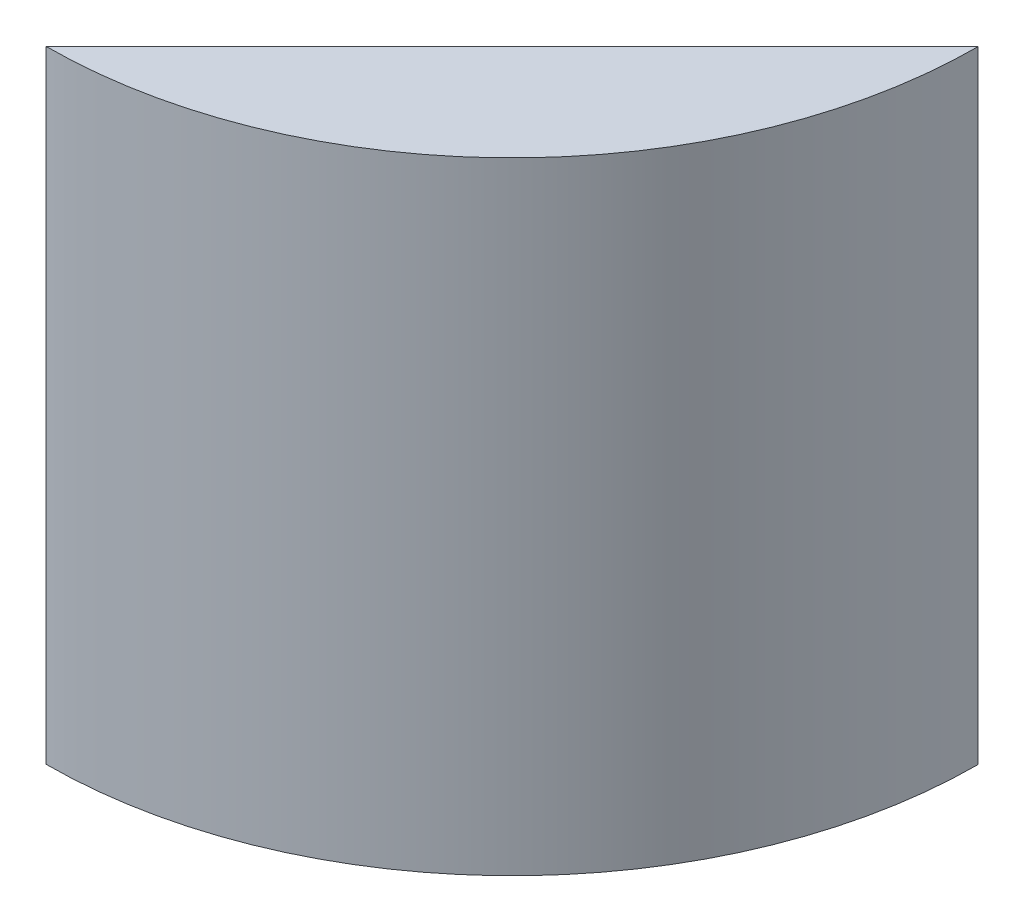
ISO-10303-21;
HEADER;
FILE_DESCRIPTION(('STEP AP214'),'2;1');
FILE_NAME('part.step','',(''),(''),'','','');
FILE_SCHEMA(('AUTOMOTIVE_DESIGN { 1 0 10303 214 1 1 1 1 }'));
ENDSEC;
DATA;
#1=APPLICATION_CONTEXT('core data for automotive mechanical design processes');
#2=APPLICATION_PROTOCOL_DEFINITION('international standard','automotive_design',2000,#1);
#3=PRODUCT_CONTEXT('',#1,'mechanical');
#4=PRODUCT('Part','Part','',(#3));
#5=PRODUCT_RELATED_PRODUCT_CATEGORY('part','',(#4));
#6=PRODUCT_DEFINITION_FORMATION('','',#4);
#7=PRODUCT_DEFINITION_CONTEXT('part definition',#1,'design');
#8=PRODUCT_DEFINITION('design','',#6,#7);
#9=PRODUCT_DEFINITION_SHAPE('','',#8);
#10=(LENGTH_UNIT() NAMED_UNIT(*) SI_UNIT(.MILLI.,.METRE.));
#11=(NAMED_UNIT(*) PLANE_ANGLE_UNIT() SI_UNIT($,.RADIAN.));
#12=(NAMED_UNIT(*) SI_UNIT($,.STERADIAN.) SOLID_ANGLE_UNIT());
#13=UNCERTAINTY_MEASURE_WITH_UNIT(LENGTH_MEASURE(1.E-05),#10,'distance_accuracy_value','');
#14=(GEOMETRIC_REPRESENTATION_CONTEXT(3) GLOBAL_UNCERTAINTY_ASSIGNED_CONTEXT((#13)) GLOBAL_UNIT_ASSIGNED_CONTEXT((#10,
#11,#12)) REPRESENTATION_CONTEXT('',''));
#15=CARTESIAN_POINT('',(0.,0.,0.));
#16=DIRECTION('',(0.,0.,1.));
#17=DIRECTION('',(1.,0.,0.));
#18=AXIS2_PLACEMENT_3D('',#15,#16,#17);
#19=CARTESIAN_POINT('',(0.,114.3,0.));
#20=DIRECTION('',(0.,-1.,0.));
#21=DIRECTION('',(0.,0.,-1.));
#22=AXIS2_PLACEMENT_3D('',#19,#20,#21);
#23=CYLINDRICAL_SURFACE('',#22,85.725);
#24=CARTESIAN_POINT('',(0.,0.,0.));
#25=DIRECTION('',(0.,1.,0.));
#26=DIRECTION('',(0.,0.,1.));
#27=AXIS2_PLACEMENT_3D('',#24,#25,#26);
#28=CIRCLE('',#27,85.725);
#29=CARTESIAN_POINT('',(0.,0.,85.725));
#30=VERTEX_POINT('',#29);
#31=CARTESIAN_POINT('',(85.7249336213076,0.,0.106680000000005));
#32=VERTEX_POINT('',#31);
#33=EDGE_CURVE('E71',#30,#32,#28,.T.);
#34=ORIENTED_EDGE('',*,*,#33,.T.);
#35=DIRECTION('',(0.,1.,0.));
#36=VECTOR('',#35,1.);
#37=CARTESIAN_POINT('',(85.7249336213076,-38.1,0.106680000000005));
#38=LINE('',#37,#36);
#39=CARTESIAN_POINT('',(85.7249336213076,114.3,0.106680000000005));
#40=VERTEX_POINT('',#39);
#41=EDGE_CURVE('E50',#32,#40,#38,.T.);
#42=ORIENTED_EDGE('',*,*,#41,.T.);
#43=CARTESIAN_POINT('',(0.,114.3,0.));
#44=DIRECTION('',(0.,1.,0.));
#45=DIRECTION('',(0.,0.,1.));
#46=AXIS2_PLACEMENT_3D('',#43,#44,#45);
#47=CIRCLE('',#46,85.725);
#48=CARTESIAN_POINT('',(0.,114.3,85.725));
#49=VERTEX_POINT('',#48);
#50=EDGE_CURVE('E43',#49,#40,#47,.T.);
#51=ORIENTED_EDGE('',*,*,#50,.F.);
#52=DIRECTION('',(0.,1.,0.));
#53=VECTOR('',#52,1.);
#54=CARTESIAN_POINT('',(0.,-38.1,85.725));
#55=LINE('',#54,#53);
#56=EDGE_CURVE('E57',#30,#49,#55,.T.);
#57=ORIENTED_EDGE('',*,*,#56,.F.);
#58=EDGE_LOOP('',(#34,#42,#51,#57));
#59=FACE_BOUND('',#58,.T.);
#60=ADVANCED_FACE('F36',(#59),#23,.T.);
#61=CARTESIAN_POINT('',(0.,114.3,0.));
#62=DIRECTION('',(0.,1.,0.));
#63=DIRECTION('',(0.,0.,1.));
#64=AXIS2_PLACEMENT_3D('',#61,#62,#63);
#65=PLANE('',#64);
#66=DIRECTION('',(0.707546621942485,0.,-0.706666666666667));
#67=VECTOR('',#66,1.);
#68=CARTESIAN_POINT('',(85.7249336213076,114.3,0.106680000000005));
#69=LINE('',#68,#67);
#70=EDGE_CURVE('E60',#49,#40,#69,.T.);
#71=ORIENTED_EDGE('',*,*,#70,.F.);
#72=ORIENTED_EDGE('',*,*,#50,.T.);
#73=EDGE_LOOP('',(#71,#72));
#74=FACE_BOUND('',#73,.T.);
#75=ADVANCED_FACE('F68',(#74),#65,.T.);
#76=CARTESIAN_POINT('',(0.,0.,0.));
#77=DIRECTION('',(0.,1.,0.));
#78=DIRECTION('',(0.,0.,1.));
#79=AXIS2_PLACEMENT_3D('',#76,#77,#78);
#80=PLANE('',#79);
#81=CARTESIAN_POINT('',(51.8371334773205,0.,51.9016820986696));
#82=DIRECTION('',(0.,-1.,0.));
#83=DIRECTION('',(0.,0.,-1.));
#84=AXIS2_PLACEMENT_3D('',#81,#82,#83);
#85=CIRCLE('',#84,6.985);
#86=CARTESIAN_POINT('',(51.8371334773205,0.,44.9166820986696));
#87=VERTEX_POINT('',#86);
#88=EDGE_CURVE('E99',#87,#87,#85,.T.);
#89=ORIENTED_EDGE('',*,*,#88,.F.);
#90=EDGE_LOOP('',(#89));
#91=FACE_BOUND('',#90,.T.);
#92=ORIENTED_EDGE('',*,*,#33,.F.);
#93=DIRECTION('',(0.707546621942485,0.,-0.706666666666667));
#94=VECTOR('',#93,1.);
#95=CARTESIAN_POINT('',(42.8624668106538,0.,42.91584));
#96=LINE('',#95,#94);
#97=EDGE_CURVE('E11',#30,#32,#96,.T.);
#98=ORIENTED_EDGE('',*,*,#97,.T.);
#99=EDGE_LOOP('',(#92,#98));
#100=FACE_BOUND('',#99,.T.);
#101=ADVANCED_FACE('F114',(#91,#100),#80,.F.);
#102=CARTESIAN_POINT('',(85.7249336213076,-38.1,0.106680000000005));
#103=DIRECTION('',(0.706666666666667,0.,0.707546621942485));
#104=DIRECTION('',(0.707546621942485,0.,-0.706666666666667));
#105=AXIS2_PLACEMENT_3D('',#102,#103,#104);
#106=PLANE('',#105);
#107=CARTESIAN_POINT('',(14.1229867300694,25.4,71.6195776201769));
#108=DIRECTION('',(-0.706666666666667,0.,-0.707546621942485));
#109=DIRECTION('',(-0.707546621942485,0.,0.706666666666667));
#110=AXIS2_PLACEMENT_3D('',#107,#108,#109);
#111=CIRCLE('',#110,2.778125);
#112=CARTESIAN_POINT('',(12.1573337709855,25.4,73.5827859535103));
#113=VERTEX_POINT('',#112);
#114=EDGE_CURVE('E81',#113,#113,#111,.T.);
#115=ORIENTED_EDGE('',*,*,#114,.F.);
#116=EDGE_LOOP('',(#115));
#117=FACE_BOUND('',#116,.T.);
#118=CARTESIAN_POINT('',(46.2923013684471,25.4,39.4902710282766));
#119=DIRECTION('',(-0.706666666666667,0.,-0.707546621942485));
#120=DIRECTION('',(-0.707546621942485,0.,0.706666666666667));
#121=AXIS2_PLACEMENT_3D('',#118,#119,#120);
#122=CIRCLE('',#121,2.778125);
#123=CARTESIAN_POINT('',(44.3266484093631,25.4,41.4534793616099));
#124=VERTEX_POINT('',#123);
#125=EDGE_CURVE('E88',#124,#124,#122,.T.);
#126=ORIENTED_EDGE('',*,*,#125,.F.);
#127=EDGE_LOOP('',(#126));
#128=FACE_BOUND('',#127,.T.);
#129=CARTESIAN_POINT('',(46.2923013684471,93.472,39.4902710282766));
#130=DIRECTION('',(-0.706666666666667,0.,-0.707546621942485));
#131=DIRECTION('',(-0.707546621942485,0.,0.706666666666667));
#132=AXIS2_PLACEMENT_3D('',#129,#130,#131);
#133=CIRCLE('',#132,2.778125);
#134=CARTESIAN_POINT('',(44.3266484093631,93.472,41.4534793616099));
#135=VERTEX_POINT('',#134);
#136=EDGE_CURVE('E94',#135,#135,#133,.T.);
#137=ORIENTED_EDGE('',*,*,#136,.F.);
#138=EDGE_LOOP('',(#137));
#139=FACE_BOUND('',#138,.T.);
#140=CARTESIAN_POINT('',(14.1229866754913,93.472,71.6195776746872));
#141=DIRECTION('',(-0.706666666666667,0.,-0.707546621942485));
#142=DIRECTION('',(-0.707546621942485,0.,0.706666666666667));
#143=AXIS2_PLACEMENT_3D('',#140,#141,#142);
#144=CIRCLE('',#143,2.778125);
#145=CARTESIAN_POINT('',(12.1573337164073,93.472,73.5827860080206));
#146=VERTEX_POINT('',#145);
#147=EDGE_CURVE('E75',#146,#146,#144,.T.);
#148=ORIENTED_EDGE('',*,*,#147,.F.);
#149=EDGE_LOOP('',(#148));
#150=FACE_BOUND('',#149,.T.);
#151=ORIENTED_EDGE('',*,*,#56,.T.);
#152=ORIENTED_EDGE('',*,*,#70,.T.);
#153=ORIENTED_EDGE('',*,*,#41,.F.);
#154=ORIENTED_EDGE('',*,*,#97,.F.);
#155=EDGE_LOOP('',(#151,#152,#153,#154));
#156=FACE_BOUND('',#155,.T.);
#157=ADVANCED_FACE('F59',(#117,#128,#139,#150,#156),#106,.F.);
#158=CARTESIAN_POINT('',(23.0976533421579,93.472,80.6054197733568));
#159=DIRECTION('',(-0.706666666666667,0.,-0.707546621942485));
#160=DIRECTION('',(-0.707546621942485,0.,0.706666666666667));
#161=AXIS2_PLACEMENT_3D('',#158,#159,#160);
#162=CYLINDRICAL_SURFACE('',#161,2.778125);
#163=CARTESIAN_POINT('',(23.0976533421579,93.472,80.6054197733568));
#164=DIRECTION('',(-0.706666666666667,0.,-0.707546621942485));
#165=DIRECTION('',(-0.707546621942485,0.,0.706666666666667));
#166=AXIS2_PLACEMENT_3D('',#163,#164,#165);
#167=CIRCLE('',#166,2.778125);
#168=CARTESIAN_POINT('',(21.132000383074,93.472,82.5686281066901));
#169=VERTEX_POINT('',#168);
#170=EDGE_CURVE('E69',#169,#169,#167,.T.);
#171=ORIENTED_EDGE('',*,*,#170,.F.);
#172=EDGE_LOOP('',(#171));
#173=FACE_BOUND('',#172,.T.);
#174=ORIENTED_EDGE('',*,*,#147,.T.);
#175=EDGE_LOOP('',(#174));
#176=FACE_BOUND('',#175,.T.);
#177=ADVANCED_FACE('F121',(#173,#176),#162,.F.);
#178=CARTESIAN_POINT('',(23.0976533421579,93.472,80.6054197733568));
#179=DIRECTION('',(-0.706666666666667,0.,-0.707546621942485));
#180=DIRECTION('',(-0.707546621942485,0.,0.706666666666667));
#181=AXIS2_PLACEMENT_3D('',#178,#179,#180);
#182=PLANE('',#181);
#183=ORIENTED_EDGE('',*,*,#170,.T.);
#184=EDGE_LOOP('',(#183));
#185=FACE_BOUND('',#184,.T.);
#186=ADVANCED_FACE('F148',(#185),#182,.T.);
#187=CARTESIAN_POINT('',(55.2669680351137,93.472,48.4761131269462));
#188=DIRECTION('',(-0.706666666666667,0.,-0.707546621942485));
#189=DIRECTION('',(-0.707546621942485,0.,0.706666666666667));
#190=AXIS2_PLACEMENT_3D('',#187,#188,#189);
#191=CYLINDRICAL_SURFACE('',#190,2.778125);
#192=CARTESIAN_POINT('',(55.2669680351137,93.472,48.4761131269462));
#193=DIRECTION('',(-0.706666666666667,0.,-0.707546621942485));
#194=DIRECTION('',(-0.707546621942485,0.,0.706666666666667));
#195=AXIS2_PLACEMENT_3D('',#192,#193,#194);
#196=CIRCLE('',#195,2.778125);
#197=CARTESIAN_POINT('',(53.3013150760298,93.472,50.4393214602795));
#198=VERTEX_POINT('',#197);
#199=EDGE_CURVE('E78',#198,#198,#196,.T.);
#200=ORIENTED_EDGE('',*,*,#199,.F.);
#201=EDGE_LOOP('',(#200));
#202=FACE_BOUND('',#201,.T.);
#203=ORIENTED_EDGE('',*,*,#136,.T.);
#204=EDGE_LOOP('',(#203));
#205=FACE_BOUND('',#204,.T.);
#206=ADVANCED_FACE('F158',(#202,#205),#191,.F.);
#207=CARTESIAN_POINT('',(55.2669680351137,93.472,48.4761131269462));
#208=DIRECTION('',(-0.706666666666667,0.,-0.707546621942485));
#209=DIRECTION('',(-0.707546621942485,0.,0.706666666666667));
#210=AXIS2_PLACEMENT_3D('',#207,#208,#209);
#211=PLANE('',#210);
#212=ORIENTED_EDGE('',*,*,#199,.T.);
#213=EDGE_LOOP('',(#212));
#214=FACE_BOUND('',#213,.T.);
#215=ADVANCED_FACE('F168',(#214),#211,.T.);
#216=CARTESIAN_POINT('',(55.2669680351137,25.4,48.4761131269462));
#217=DIRECTION('',(-0.706666666666667,0.,-0.707546621942485));
#218=DIRECTION('',(-0.707546621942485,0.,0.706666666666667));
#219=AXIS2_PLACEMENT_3D('',#216,#217,#218);
#220=CYLINDRICAL_SURFACE('',#219,2.778125);
#221=CARTESIAN_POINT('',(55.2669680351137,25.4,48.4761131269462));
#222=DIRECTION('',(-0.706666666666667,0.,-0.707546621942485));
#223=DIRECTION('',(-0.707546621942485,0.,0.706666666666667));
#224=AXIS2_PLACEMENT_3D('',#221,#222,#223);
#225=CIRCLE('',#224,2.778125);
#226=CARTESIAN_POINT('',(53.3013150760298,25.4,50.4393214602795));
#227=VERTEX_POINT('',#226);
#228=EDGE_CURVE('E91',#227,#227,#225,.T.);
#229=ORIENTED_EDGE('',*,*,#228,.F.);
#230=EDGE_LOOP('',(#229));
#231=FACE_BOUND('',#230,.T.);
#232=ORIENTED_EDGE('',*,*,#125,.T.);
#233=EDGE_LOOP('',(#232));
#234=FACE_BOUND('',#233,.T.);
#235=ADVANCED_FACE('F178',(#231,#234),#220,.F.);
#236=CARTESIAN_POINT('',(55.2669680351137,25.4,48.4761131269462));
#237=DIRECTION('',(-0.706666666666667,0.,-0.707546621942485));
#238=DIRECTION('',(-0.707546621942485,0.,0.706666666666667));
#239=AXIS2_PLACEMENT_3D('',#236,#237,#238);
#240=PLANE('',#239);
#241=ORIENTED_EDGE('',*,*,#228,.T.);
#242=EDGE_LOOP('',(#241));
#243=FACE_BOUND('',#242,.T.);
#244=ADVANCED_FACE('F188',(#243),#240,.T.);
#245=CARTESIAN_POINT('',(23.0976533967361,25.4,80.6054197188465));
#246=DIRECTION('',(-0.706666666666667,0.,-0.707546621942485));
#247=DIRECTION('',(-0.707546621942485,0.,0.706666666666667));
#248=AXIS2_PLACEMENT_3D('',#245,#246,#247);
#249=CYLINDRICAL_SURFACE('',#248,2.778125);
#250=CARTESIAN_POINT('',(23.0976533967361,25.4,80.6054197188465));
#251=DIRECTION('',(-0.706666666666667,0.,-0.707546621942485));
#252=DIRECTION('',(-0.707546621942485,0.,0.706666666666667));
#253=AXIS2_PLACEMENT_3D('',#250,#251,#252);
#254=CIRCLE('',#253,2.778125);
#255=CARTESIAN_POINT('',(21.1320004376521,25.4,82.5686280521798));
#256=VERTEX_POINT('',#255);
#257=EDGE_CURVE('E84',#256,#256,#254,.T.);
#258=ORIENTED_EDGE('',*,*,#257,.F.);
#259=EDGE_LOOP('',(#258));
#260=FACE_BOUND('',#259,.T.);
#261=ORIENTED_EDGE('',*,*,#114,.T.);
#262=EDGE_LOOP('',(#261));
#263=FACE_BOUND('',#262,.T.);
#264=ADVANCED_FACE('F198',(#260,#263),#249,.F.);
#265=CARTESIAN_POINT('',(23.0976533967361,25.4,80.6054197188465));
#266=DIRECTION('',(-0.706666666666667,0.,-0.707546621942485));
#267=DIRECTION('',(-0.707546621942485,0.,0.706666666666667));
#268=AXIS2_PLACEMENT_3D('',#265,#266,#267);
#269=PLANE('',#268);
#270=ORIENTED_EDGE('',*,*,#257,.T.);
#271=EDGE_LOOP('',(#270));
#272=FACE_BOUND('',#271,.T.);
#273=ADVANCED_FACE('F110',(#272),#269,.T.);
#274=CARTESIAN_POINT('',(51.8371334773205,6.35,51.9016820986696));
#275=DIRECTION('',(0.,-1.,0.));
#276=DIRECTION('',(0.,0.,-1.));
#277=AXIS2_PLACEMENT_3D('',#274,#275,#276);
#278=CYLINDRICAL_SURFACE('',#277,6.985);
#279=CARTESIAN_POINT('',(51.8371334773205,6.35,51.9016820986696));
#280=DIRECTION('',(0.,-1.,0.));
#281=DIRECTION('',(0.,0.,-1.));
#282=AXIS2_PLACEMENT_3D('',#279,#280,#281);
#283=CIRCLE('',#282,6.985);
#284=CARTESIAN_POINT('',(51.8371334773205,6.35,44.9166820986696));
#285=VERTEX_POINT('',#284);
#286=EDGE_CURVE('E85',#285,#285,#283,.T.);
#287=ORIENTED_EDGE('',*,*,#286,.F.);
#288=EDGE_LOOP('',(#287));
#289=FACE_BOUND('',#288,.T.);
#290=ORIENTED_EDGE('',*,*,#88,.T.);
#291=EDGE_LOOP('',(#290));
#292=FACE_BOUND('',#291,.T.);
#293=ADVANCED_FACE('F107',(#289,#292),#278,.F.);
#294=CARTESIAN_POINT('',(51.8371334773205,6.35,51.9016820986696));
#295=DIRECTION('',(0.,-1.,0.));
#296=DIRECTION('',(0.,0.,-1.));
#297=AXIS2_PLACEMENT_3D('',#294,#295,#296);
#298=PLANE('',#297);
#299=ORIENTED_EDGE('',*,*,#286,.T.);
#300=EDGE_LOOP('',(#299));
#301=FACE_BOUND('',#300,.T.);
#302=ADVANCED_FACE('F105',(#301),#298,.T.);
#303=CLOSED_SHELL('',(#60,#75,#101,#157,#177,#186,#206,#215,#235,#244,#264,#273,#293,#302));
#304=MANIFOLD_SOLID_BREP('B2',#303);
#305=ADVANCED_BREP_SHAPE_REPRESENTATION('',(#18,#304),#14);
#306=SHAPE_DEFINITION_REPRESENTATION(#9,#305);
ENDSEC;
END-ISO-10303-21;
